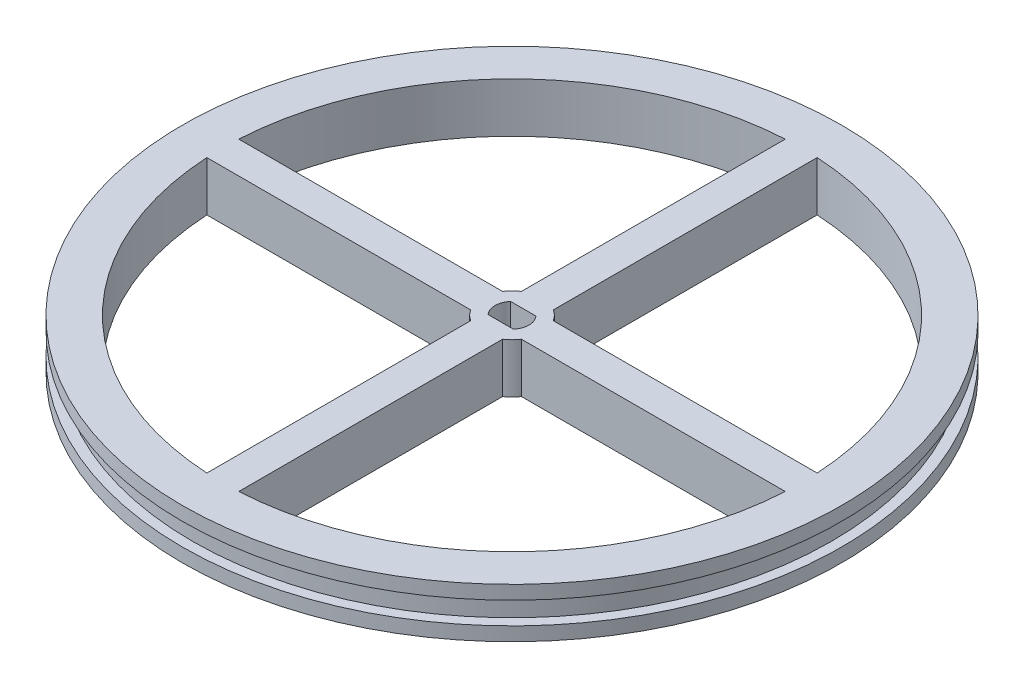
ISO-10303-21;
HEADER;
FILE_DESCRIPTION(('STEP AP214'),'2;1');
FILE_NAME('part.step','',(''),(''),'','','');
FILE_SCHEMA(('AUTOMOTIVE_DESIGN { 1 0 10303 214 1 1 1 1 }'));
ENDSEC;
DATA;
#1=APPLICATION_CONTEXT('core data for automotive mechanical design processes');
#2=APPLICATION_PROTOCOL_DEFINITION('international standard','automotive_design',2000,#1);
#3=PRODUCT_CONTEXT('',#1,'mechanical');
#4=PRODUCT('Part','Part','',(#3));
#5=PRODUCT_RELATED_PRODUCT_CATEGORY('part','',(#4));
#6=PRODUCT_DEFINITION_FORMATION('','',#4);
#7=PRODUCT_DEFINITION_CONTEXT('part definition',#1,'design');
#8=PRODUCT_DEFINITION('design','',#6,#7);
#9=PRODUCT_DEFINITION_SHAPE('','',#8);
#10=(LENGTH_UNIT() NAMED_UNIT(*) SI_UNIT(.MILLI.,.METRE.));
#11=(NAMED_UNIT(*) PLANE_ANGLE_UNIT() SI_UNIT($,.RADIAN.));
#12=(NAMED_UNIT(*) SI_UNIT($,.STERADIAN.) SOLID_ANGLE_UNIT());
#13=UNCERTAINTY_MEASURE_WITH_UNIT(LENGTH_MEASURE(1.E-05),#10,'distance_accuracy_value','');
#14=(GEOMETRIC_REPRESENTATION_CONTEXT(3) GLOBAL_UNCERTAINTY_ASSIGNED_CONTEXT((#13)) GLOBAL_UNIT_ASSIGNED_CONTEXT((#10,
#11,#12)) REPRESENTATION_CONTEXT('',''));
#15=CARTESIAN_POINT('',(0.,0.,0.));
#16=DIRECTION('',(0.,0.,1.));
#17=DIRECTION('',(1.,0.,0.));
#18=AXIS2_PLACEMENT_3D('',#15,#16,#17);
#19=CARTESIAN_POINT('',(0.,7.9,0.));
#20=DIRECTION('',(0.,-1.,0.));
#21=DIRECTION('',(0.,0.,-1.));
#22=AXIS2_PLACEMENT_3D('',#19,#20,#21);
#23=CYLINDRICAL_SURFACE('',#22,52.3875);
#24=CARTESIAN_POINT('',(0.,0.,0.));
#25=DIRECTION('',(0.,1.,0.));
#26=DIRECTION('',(0.,0.,1.));
#27=AXIS2_PLACEMENT_3D('',#24,#25,#26);
#28=CIRCLE('',#27,52.3875);
#29=CARTESIAN_POINT('',(0.,0.,52.3875));
#30=VERTEX_POINT('',#29);
#31=EDGE_CURVE('E277',#30,#30,#28,.T.);
#32=ORIENTED_EDGE('',*,*,#31,.T.);
#33=EDGE_LOOP('',(#32));
#34=FACE_BOUND('',#33,.T.);
#35=CARTESIAN_POINT('',(0.,2.1847,0.));
#36=DIRECTION('',(0.,1.,0.));
#37=DIRECTION('',(0.,0.,1.));
#38=AXIS2_PLACEMENT_3D('',#35,#36,#37);
#39=CIRCLE('',#38,52.3875);
#40=CARTESIAN_POINT('',(0.,2.1847,52.3875));
#41=VERTEX_POINT('',#40);
#42=EDGE_CURVE('E227',#41,#41,#39,.T.);
#43=ORIENTED_EDGE('',*,*,#42,.F.);
#44=EDGE_LOOP('',(#43));
#45=FACE_BOUND('',#44,.T.);
#46=ADVANCED_FACE('F47',(#34,#45),#23,.T.);
#47=CARTESIAN_POINT('',(0.,7.9,0.));
#48=DIRECTION('',(0.,-1.,0.));
#49=DIRECTION('',(0.,0.,-1.));
#50=AXIS2_PLACEMENT_3D('',#47,#48,#49);
#51=CYLINDRICAL_SURFACE('',#50,46.0375);
#52=CARTESIAN_POINT('',(0.,0.,0.));
#53=DIRECTION('',(0.,1.,0.));
#54=DIRECTION('',(0.,0.,1.));
#55=AXIS2_PLACEMENT_3D('',#52,#53,#54);
#56=CIRCLE('',#55,46.0375);
#57=CARTESIAN_POINT('',(-45.9673776307729,0.,2.53999999998384));
#58=VERTEX_POINT('',#57);
#59=CARTESIAN_POINT('',(-2.54000000001079,0.,45.9673776307714));
#60=VERTEX_POINT('',#59);
#61=EDGE_CURVE('E271',#58,#60,#56,.T.);
#62=ORIENTED_EDGE('',*,*,#61,.F.);
#63=DIRECTION('',(0.,-1.,0.));
#64=VECTOR('',#63,1.);
#65=CARTESIAN_POINT('',(-45.9673776307729,7.9,2.53999999998384));
#66=LINE('',#65,#64);
#67=CARTESIAN_POINT('',(-45.9673776307729,7.9,2.53999999998384));
#68=VERTEX_POINT('',#67);
#69=EDGE_CURVE('E12',#68,#58,#66,.T.);
#70=ORIENTED_EDGE('',*,*,#69,.F.);
#71=CARTESIAN_POINT('',(0.,7.9,0.));
#72=DIRECTION('',(0.,1.,0.));
#73=DIRECTION('',(0.,0.,1.));
#74=AXIS2_PLACEMENT_3D('',#71,#72,#73);
#75=CIRCLE('',#74,46.0375);
#76=CARTESIAN_POINT('',(-2.54000000001079,7.9,45.9673776307714));
#77=VERTEX_POINT('',#76);
#78=EDGE_CURVE('E212',#68,#77,#75,.T.);
#79=ORIENTED_EDGE('',*,*,#78,.T.);
#80=DIRECTION('',(0.,-1.,0.));
#81=VECTOR('',#80,1.);
#82=CARTESIAN_POINT('',(-2.54000000001079,7.9,45.9673776307714));
#83=LINE('',#82,#81);
#84=EDGE_CURVE('E137',#77,#60,#83,.T.);
#85=ORIENTED_EDGE('',*,*,#84,.T.);
#86=EDGE_LOOP('',(#62,#70,#79,#85));
#87=FACE_BOUND('',#86,.T.);
#88=ADVANCED_FACE('F345',(#87),#51,.F.);
#89=CARTESIAN_POINT('',(-8.89565653090244E-13,7.9,2.53999999999994));
#90=DIRECTION('',(-3.50222698067034E-13,0.,1.));
#91=DIRECTION('',(1.,0.,3.50222698067034E-13));
#92=AXIS2_PLACEMENT_3D('',#89,#90,#91);
#93=PLANE('',#92);
#94=DIRECTION('',(-1.,0.,-3.50222698067034E-13));
#95=VECTOR('',#94,1.);
#96=CARTESIAN_POINT('',(-8.89565653090244E-13,0.,2.53999999999994));
#97=LINE('',#96,#95);
#98=CARTESIAN_POINT('',(-4.02862336909361,0.,2.53999999999853));
#99=VERTEX_POINT('',#98);
#100=EDGE_CURVE('E201',#99,#58,#97,.T.);
#101=ORIENTED_EDGE('',*,*,#100,.F.);
#102=DIRECTION('',(0.,-1.,0.));
#103=VECTOR('',#102,1.);
#104=CARTESIAN_POINT('',(-4.02862336909361,7.9,2.53999999999853));
#105=LINE('',#104,#103);
#106=CARTESIAN_POINT('',(-4.02862336909361,7.9,2.53999999999853));
#107=VERTEX_POINT('',#106);
#108=EDGE_CURVE('E57',#107,#99,#105,.T.);
#109=ORIENTED_EDGE('',*,*,#108,.F.);
#110=DIRECTION('',(-1.,0.,-3.50222698067034E-13));
#111=VECTOR('',#110,1.);
#112=CARTESIAN_POINT('',(-8.89565653090244E-13,7.9,2.53999999999994));
#113=LINE('',#112,#111);
#114=EDGE_CURVE('E199',#107,#68,#113,.T.);
#115=ORIENTED_EDGE('',*,*,#114,.T.);
#116=ORIENTED_EDGE('',*,*,#69,.T.);
#117=EDGE_LOOP('',(#101,#109,#115,#116));
#118=FACE_BOUND('',#117,.T.);
#119=ADVANCED_FACE('F197',(#118),#93,.T.);
#120=CARTESIAN_POINT('',(0.,7.9,0.));
#121=DIRECTION('',(0.,-1.,0.));
#122=DIRECTION('',(0.,0.,-1.));
#123=AXIS2_PLACEMENT_3D('',#120,#121,#122);
#124=CYLINDRICAL_SURFACE('',#123,4.76249999999997);
#125=CARTESIAN_POINT('',(0.,0.,0.));
#126=DIRECTION('',(0.,1.,0.));
#127=DIRECTION('',(0.,0.,1.));
#128=AXIS2_PLACEMENT_3D('',#125,#126,#127);
#129=CIRCLE('',#128,4.76249999999997);
#130=CARTESIAN_POINT('',(-2.540000000001,0.,4.02862336909206));
#131=VERTEX_POINT('',#130);
#132=EDGE_CURVE('E274',#99,#131,#129,.T.);
#133=ORIENTED_EDGE('',*,*,#132,.T.);
#134=DIRECTION('',(0.,-1.,0.));
#135=VECTOR('',#134,1.);
#136=CARTESIAN_POINT('',(-2.540000000001,7.9,4.02862336909206));
#137=LINE('',#136,#135);
#138=CARTESIAN_POINT('',(-2.540000000001,7.9,4.02862336909206));
#139=VERTEX_POINT('',#138);
#140=EDGE_CURVE('E204',#139,#131,#137,.T.);
#141=ORIENTED_EDGE('',*,*,#140,.F.);
#142=CARTESIAN_POINT('',(0.,7.9,0.));
#143=DIRECTION('',(0.,1.,0.));
#144=DIRECTION('',(0.,0.,1.));
#145=AXIS2_PLACEMENT_3D('',#142,#143,#144);
#146=CIRCLE('',#145,4.76249999999997);
#147=EDGE_CURVE('E207',#107,#139,#146,.T.);
#148=ORIENTED_EDGE('',*,*,#147,.F.);
#149=ORIENTED_EDGE('',*,*,#108,.T.);
#150=EDGE_LOOP('',(#133,#141,#148,#149));
#151=FACE_BOUND('',#150,.T.);
#152=ADVANCED_FACE('F208',(#151),#124,.T.);
#153=CARTESIAN_POINT('',(0.,7.9,0.));
#154=DIRECTION('',(0.,-1.,0.));
#155=DIRECTION('',(0.,0.,-1.));
#156=AXIS2_PLACEMENT_3D('',#153,#154,#155);
#157=CYLINDRICAL_SURFACE('',#156,2.7);
#158=CARTESIAN_POINT('',(0.,0.,0.));
#159=DIRECTION('',(0.,1.,0.));
#160=DIRECTION('',(0.,0.,1.));
#161=AXIS2_PLACEMENT_3D('',#158,#159,#160);
#162=CIRCLE('',#161,2.7);
#163=CARTESIAN_POINT('',(2.01246117974981,0.,1.8));
#164=VERTEX_POINT('',#163);
#165=CARTESIAN_POINT('',(2.01246117974981,0.,-1.8));
#166=VERTEX_POINT('',#165);
#167=EDGE_CURVE('E259',#164,#166,#162,.T.);
#168=ORIENTED_EDGE('',*,*,#167,.F.);
#169=DIRECTION('',(0.,-1.,0.));
#170=VECTOR('',#169,1.);
#171=CARTESIAN_POINT('',(2.01246117974981,7.9,1.8));
#172=LINE('',#171,#170);
#173=CARTESIAN_POINT('',(2.01246117974981,7.9,1.8));
#174=VERTEX_POINT('',#173);
#175=EDGE_CURVE('E282',#174,#164,#172,.T.);
#176=ORIENTED_EDGE('',*,*,#175,.F.);
#177=CARTESIAN_POINT('',(0.,7.9,0.));
#178=DIRECTION('',(0.,1.,0.));
#179=DIRECTION('',(0.,0.,1.));
#180=AXIS2_PLACEMENT_3D('',#177,#178,#179);
#181=CIRCLE('',#180,2.7);
#182=CARTESIAN_POINT('',(2.01246117974981,7.9,-1.8));
#183=VERTEX_POINT('',#182);
#184=EDGE_CURVE('E408',#174,#183,#181,.T.);
#185=ORIENTED_EDGE('',*,*,#184,.T.);
#186=DIRECTION('',(0.,-1.,0.));
#187=VECTOR('',#186,1.);
#188=CARTESIAN_POINT('',(2.01246117974981,7.9,-1.8));
#189=LINE('',#188,#187);
#190=EDGE_CURVE('E284',#183,#166,#189,.T.);
#191=ORIENTED_EDGE('',*,*,#190,.T.);
#192=EDGE_LOOP('',(#168,#176,#185,#191));
#193=FACE_BOUND('',#192,.T.);
#194=ADVANCED_FACE('F426',(#193),#157,.F.);
#195=CARTESIAN_POINT('',(0.,7.9,1.8));
#196=DIRECTION('',(0.,0.,-1.));
#197=DIRECTION('',(-1.,0.,0.));
#198=AXIS2_PLACEMENT_3D('',#195,#196,#197);
#199=PLANE('',#198);
#200=DIRECTION('',(1.,0.,0.));
#201=VECTOR('',#200,1.);
#202=CARTESIAN_POINT('',(0.,0.,1.8));
#203=LINE('',#202,#201);
#204=CARTESIAN_POINT('',(-2.01246117974981,0.,1.8));
#205=VERTEX_POINT('',#204);
#206=EDGE_CURVE('E262',#205,#164,#203,.T.);
#207=ORIENTED_EDGE('',*,*,#206,.F.);
#208=DIRECTION('',(0.,-1.,0.));
#209=VECTOR('',#208,1.);
#210=CARTESIAN_POINT('',(-2.01246117974981,7.9,1.8));
#211=LINE('',#210,#209);
#212=CARTESIAN_POINT('',(-2.01246117974981,7.9,1.8));
#213=VERTEX_POINT('',#212);
#214=EDGE_CURVE('E289',#213,#205,#211,.T.);
#215=ORIENTED_EDGE('',*,*,#214,.F.);
#216=DIRECTION('',(1.,0.,0.));
#217=VECTOR('',#216,1.);
#218=CARTESIAN_POINT('',(0.,7.9,1.8));
#219=LINE('',#218,#217);
#220=EDGE_CURVE('E411',#213,#174,#219,.T.);
#221=ORIENTED_EDGE('',*,*,#220,.T.);
#222=ORIENTED_EDGE('',*,*,#175,.T.);
#223=EDGE_LOOP('',(#207,#215,#221,#222));
#224=FACE_BOUND('',#223,.T.);
#225=ADVANCED_FACE('F429',(#224),#199,.T.);
#226=CARTESIAN_POINT('',(0.,7.9,0.));
#227=DIRECTION('',(0.,-1.,0.));
#228=DIRECTION('',(0.,0.,-1.));
#229=AXIS2_PLACEMENT_3D('',#226,#227,#228);
#230=CYLINDRICAL_SURFACE('',#229,2.7);
#231=CARTESIAN_POINT('',(0.,0.,0.));
#232=DIRECTION('',(0.,1.,0.));
#233=DIRECTION('',(0.,0.,1.));
#234=AXIS2_PLACEMENT_3D('',#231,#232,#233);
#235=CIRCLE('',#234,2.7);
#236=CARTESIAN_POINT('',(-2.01246117974981,0.,-1.8));
#237=VERTEX_POINT('',#236);
#238=EDGE_CURVE('E265',#237,#205,#235,.T.);
#239=ORIENTED_EDGE('',*,*,#238,.F.);
#240=DIRECTION('',(0.,-1.,0.));
#241=VECTOR('',#240,1.);
#242=CARTESIAN_POINT('',(-2.01246117974981,7.9,-1.8));
#243=LINE('',#242,#241);
#244=CARTESIAN_POINT('',(-2.01246117974981,7.9,-1.8));
#245=VERTEX_POINT('',#244);
#246=EDGE_CURVE('E286',#245,#237,#243,.T.);
#247=ORIENTED_EDGE('',*,*,#246,.F.);
#248=CARTESIAN_POINT('',(0.,7.9,0.));
#249=DIRECTION('',(0.,1.,0.));
#250=DIRECTION('',(0.,0.,1.));
#251=AXIS2_PLACEMENT_3D('',#248,#249,#250);
#252=CIRCLE('',#251,2.7);
#253=EDGE_CURVE('E414',#245,#213,#252,.T.);
#254=ORIENTED_EDGE('',*,*,#253,.T.);
#255=ORIENTED_EDGE('',*,*,#214,.T.);
#256=EDGE_LOOP('',(#239,#247,#254,#255));
#257=FACE_BOUND('',#256,.T.);
#258=ADVANCED_FACE('F432',(#257),#230,.F.);
#259=CARTESIAN_POINT('',(2.53999999999994,7.9,5.9299999261304E-13));
#260=DIRECTION('',(1.,0.,2.33464564020888E-13));
#261=DIRECTION('',(2.33464564020888E-13,0.,-1.));
#262=AXIS2_PLACEMENT_3D('',#259,#260,#261);
#263=PLANE('',#262);
#264=DIRECTION('',(-2.33464564020888E-13,0.,1.));
#265=VECTOR('',#264,1.);
#266=CARTESIAN_POINT('',(2.53999999999994,0.,5.9299999261304E-13));
#267=LINE('',#266,#265);
#268=CARTESIAN_POINT('',(2.539999999999,0.,4.02862336909325));
#269=VERTEX_POINT('',#268);
#270=CARTESIAN_POINT('',(2.53999999998921,0.,45.9673776307725));
#271=VERTEX_POINT('',#270);
#272=EDGE_CURVE('E247',#269,#271,#267,.T.);
#273=ORIENTED_EDGE('',*,*,#272,.F.);
#274=DIRECTION('',(0.,-1.,0.));
#275=VECTOR('',#274,1.);
#276=CARTESIAN_POINT('',(2.539999999999,7.9,4.02862336909325));
#277=LINE('',#276,#275);
#278=CARTESIAN_POINT('',(2.539999999999,7.9,4.02862336909325));
#279=VERTEX_POINT('',#278);
#280=EDGE_CURVE('E287',#279,#269,#277,.T.);
#281=ORIENTED_EDGE('',*,*,#280,.F.);
#282=DIRECTION('',(-2.33464564020888E-13,0.,1.));
#283=VECTOR('',#282,1.);
#284=CARTESIAN_POINT('',(2.53999999999994,7.9,5.9299999261304E-13));
#285=LINE('',#284,#283);
#286=CARTESIAN_POINT('',(2.53999999998921,7.9,45.9673776307725));
#287=VERTEX_POINT('',#286);
#288=EDGE_CURVE('E397',#279,#287,#285,.T.);
#289=ORIENTED_EDGE('',*,*,#288,.T.);
#290=DIRECTION('',(0.,-1.,0.));
#291=VECTOR('',#290,1.);
#292=CARTESIAN_POINT('',(2.53999999998921,7.9,45.9673776307725));
#293=LINE('',#292,#291);
#294=EDGE_CURVE('E292',#287,#271,#293,.T.);
#295=ORIENTED_EDGE('',*,*,#294,.T.);
#296=EDGE_LOOP('',(#273,#281,#289,#295));
#297=FACE_BOUND('',#296,.T.);
#298=ADVANCED_FACE('F587',(#297),#263,.T.);
#299=CARTESIAN_POINT('',(0.,7.9,0.));
#300=DIRECTION('',(0.,-1.,0.));
#301=DIRECTION('',(0.,0.,-1.));
#302=AXIS2_PLACEMENT_3D('',#299,#300,#301);
#303=CYLINDRICAL_SURFACE('',#302,4.76249999999993);
#304=CARTESIAN_POINT('',(0.,0.,0.));
#305=DIRECTION('',(0.,1.,0.));
#306=DIRECTION('',(0.,0.,1.));
#307=AXIS2_PLACEMENT_3D('',#304,#305,#306);
#308=CIRCLE('',#307,4.76249999999993);
#309=CARTESIAN_POINT('',(4.02862336909236,0.,2.54000000000047));
#310=VERTEX_POINT('',#309);
#311=EDGE_CURVE('E250',#269,#310,#308,.T.);
#312=ORIENTED_EDGE('',*,*,#311,.T.);
#313=DIRECTION('',(0.,-1.,0.));
#314=VECTOR('',#313,1.);
#315=CARTESIAN_POINT('',(4.02862336909236,7.9,2.54000000000047));
#316=LINE('',#315,#314);
#317=CARTESIAN_POINT('',(4.02862336909236,7.9,2.54000000000047));
#318=VERTEX_POINT('',#317);
#319=EDGE_CURVE('E297',#318,#310,#316,.T.);
#320=ORIENTED_EDGE('',*,*,#319,.F.);
#321=CARTESIAN_POINT('',(0.,7.9,0.));
#322=DIRECTION('',(0.,1.,0.));
#323=DIRECTION('',(0.,0.,1.));
#324=AXIS2_PLACEMENT_3D('',#321,#322,#323);
#325=CIRCLE('',#324,4.76249999999993);
#326=EDGE_CURVE('E400',#279,#318,#325,.T.);
#327=ORIENTED_EDGE('',*,*,#326,.F.);
#328=ORIENTED_EDGE('',*,*,#280,.T.);
#329=EDGE_LOOP('',(#312,#320,#327,#328));
#330=FACE_BOUND('',#329,.T.);
#331=ADVANCED_FACE('F577',(#330),#303,.T.);
#332=CARTESIAN_POINT('',(-2.96513129140664E-13,7.9,2.54));
#333=DIRECTION('',(1.16737452417584E-13,0.,-1.));
#334=DIRECTION('',(-1.,0.,-1.16737452417584E-13));
#335=AXIS2_PLACEMENT_3D('',#332,#333,#334);
#336=PLANE('',#335);
#337=DIRECTION('',(1.,0.,1.16737452417584E-13));
#338=VECTOR('',#337,1.);
#339=CARTESIAN_POINT('',(-2.96513129140664E-13,0.,2.54));
#340=LINE('',#339,#338);
#341=CARTESIAN_POINT('',(45.9673776307717,0.,2.54000000000536));
#342=VERTEX_POINT('',#341);
#343=EDGE_CURVE('E253',#310,#342,#340,.T.);
#344=ORIENTED_EDGE('',*,*,#343,.T.);
#345=DIRECTION('',(0.,-1.,0.));
#346=VECTOR('',#345,1.);
#347=CARTESIAN_POINT('',(45.9673776307717,7.9,2.54000000000536));
#348=LINE('',#347,#346);
#349=CARTESIAN_POINT('',(45.9673776307717,7.9,2.54000000000536));
#350=VERTEX_POINT('',#349);
#351=EDGE_CURVE('E294',#350,#342,#348,.T.);
#352=ORIENTED_EDGE('',*,*,#351,.F.);
#353=DIRECTION('',(1.,0.,1.16737452417584E-13));
#354=VECTOR('',#353,1.);
#355=CARTESIAN_POINT('',(-2.96513129140664E-13,7.9,2.54));
#356=LINE('',#355,#354);
#357=EDGE_CURVE('E403',#318,#350,#356,.T.);
#358=ORIENTED_EDGE('',*,*,#357,.F.);
#359=ORIENTED_EDGE('',*,*,#319,.T.);
#360=EDGE_LOOP('',(#344,#352,#358,#359));
#361=FACE_BOUND('',#360,.T.);
#362=ADVANCED_FACE('F567',(#361),#336,.F.);
#363=CARTESIAN_POINT('',(2.96513129140664E-13,7.9,-2.54));
#364=DIRECTION('',(1.16737452417584E-13,0.,-1.));
#365=DIRECTION('',(-1.,0.,-1.16737452417584E-13));
#366=AXIS2_PLACEMENT_3D('',#363,#364,#365);
#367=PLANE('',#366);
#368=DIRECTION('',(1.,0.,1.16737452417584E-13));
#369=VECTOR('',#368,1.);
#370=CARTESIAN_POINT('',(2.96513129140664E-13,0.,-2.54));
#371=LINE('',#370,#369);
#372=CARTESIAN_POINT('',(4.02862336909296,0.,-2.53999999999953));
#373=VERTEX_POINT('',#372);
#374=CARTESIAN_POINT('',(45.9673776307722,0.,-2.53999999999464));
#375=VERTEX_POINT('',#374);
#376=EDGE_CURVE('E235',#373,#375,#371,.T.);
#377=ORIENTED_EDGE('',*,*,#376,.F.);
#378=DIRECTION('',(0.,-1.,0.));
#379=VECTOR('',#378,1.);
#380=CARTESIAN_POINT('',(4.02862336909296,7.9,-2.53999999999953));
#381=LINE('',#380,#379);
#382=CARTESIAN_POINT('',(4.02862336909296,7.9,-2.53999999999953));
#383=VERTEX_POINT('',#382);
#384=EDGE_CURVE('E295',#383,#373,#381,.T.);
#385=ORIENTED_EDGE('',*,*,#384,.F.);
#386=DIRECTION('',(1.,0.,1.16737452417584E-13));
#387=VECTOR('',#386,1.);
#388=CARTESIAN_POINT('',(2.96513129140664E-13,7.9,-2.54));
#389=LINE('',#388,#387);
#390=CARTESIAN_POINT('',(45.9673776307722,7.9,-2.53999999999464));
#391=VERTEX_POINT('',#390);
#392=EDGE_CURVE('E386',#383,#391,#389,.T.);
#393=ORIENTED_EDGE('',*,*,#392,.T.);
#394=DIRECTION('',(0.,-1.,0.));
#395=VECTOR('',#394,1.);
#396=CARTESIAN_POINT('',(45.9673776307722,7.9,-2.53999999999464));
#397=LINE('',#396,#395);
#398=EDGE_CURVE('E301',#391,#375,#397,.T.);
#399=ORIENTED_EDGE('',*,*,#398,.T.);
#400=EDGE_LOOP('',(#377,#385,#393,#399));
#401=FACE_BOUND('',#400,.T.);
#402=ADVANCED_FACE('F557',(#401),#367,.T.);
#403=CARTESIAN_POINT('',(0.,7.9,0.));
#404=DIRECTION('',(0.,-1.,0.));
#405=DIRECTION('',(0.,0.,-1.));
#406=AXIS2_PLACEMENT_3D('',#403,#404,#405);
#407=CYLINDRICAL_SURFACE('',#406,4.76249999999998);
#408=CARTESIAN_POINT('',(0.,0.,0.));
#409=DIRECTION('',(0.,1.,0.));
#410=DIRECTION('',(0.,0.,1.));
#411=AXIS2_PLACEMENT_3D('',#408,#409,#410);
#412=CIRCLE('',#411,4.76249999999998);
#413=CARTESIAN_POINT('',(2.54,0.,-4.02862336909272));
#414=VERTEX_POINT('',#413);
#415=EDGE_CURVE('E238',#373,#414,#412,.T.);
#416=ORIENTED_EDGE('',*,*,#415,.T.);
#417=DIRECTION('',(0.,-1.,0.));
#418=VECTOR('',#417,1.);
#419=CARTESIAN_POINT('',(2.54,7.9,-4.02862336909272));
#420=LINE('',#419,#418);
#421=CARTESIAN_POINT('',(2.54,7.9,-4.02862336909272));
#422=VERTEX_POINT('',#421);
#423=EDGE_CURVE('E305',#422,#414,#420,.T.);
#424=ORIENTED_EDGE('',*,*,#423,.F.);
#425=CARTESIAN_POINT('',(0.,7.9,0.));
#426=DIRECTION('',(0.,1.,0.));
#427=DIRECTION('',(0.,0.,1.));
#428=AXIS2_PLACEMENT_3D('',#425,#426,#427);
#429=CIRCLE('',#428,4.76249999999998);
#430=EDGE_CURVE('E389',#383,#422,#429,.T.);
#431=ORIENTED_EDGE('',*,*,#430,.F.);
#432=ORIENTED_EDGE('',*,*,#384,.T.);
#433=EDGE_LOOP('',(#416,#424,#431,#432));
#434=FACE_BOUND('',#433,.T.);
#435=ADVANCED_FACE('F547',(#434),#407,.T.);
#436=CARTESIAN_POINT('',(2.54,7.9,0.));
#437=DIRECTION('',(-1.,0.,0.));
#438=DIRECTION('',(0.,0.,1.));
#439=AXIS2_PLACEMENT_3D('',#436,#437,#438);
#440=PLANE('',#439);
#441=DIRECTION('',(0.,0.,-1.));
#442=VECTOR('',#441,1.);
#443=CARTESIAN_POINT('',(2.54,0.,0.));
#444=LINE('',#443,#442);
#445=CARTESIAN_POINT('',(2.54,0.,-45.967377630772));
#446=VERTEX_POINT('',#445);
#447=EDGE_CURVE('E241',#414,#446,#444,.T.);
#448=ORIENTED_EDGE('',*,*,#447,.T.);
#449=DIRECTION('',(0.,-1.,0.));
#450=VECTOR('',#449,1.);
#451=CARTESIAN_POINT('',(2.54,7.9,-45.967377630772));
#452=LINE('',#451,#450);
#453=CARTESIAN_POINT('',(2.54,7.9,-45.967377630772));
#454=VERTEX_POINT('',#453);
#455=EDGE_CURVE('E303',#454,#446,#452,.T.);
#456=ORIENTED_EDGE('',*,*,#455,.F.);
#457=DIRECTION('',(0.,0.,-1.));
#458=VECTOR('',#457,1.);
#459=CARTESIAN_POINT('',(2.54,7.9,0.));
#460=LINE('',#459,#458);
#461=EDGE_CURVE('E392',#422,#454,#460,.T.);
#462=ORIENTED_EDGE('',*,*,#461,.F.);
#463=ORIENTED_EDGE('',*,*,#423,.T.);
#464=EDGE_LOOP('',(#448,#456,#462,#463));
#465=FACE_BOUND('',#464,.T.);
#466=ADVANCED_FACE('F539',(#465),#440,.F.);
#467=CARTESIAN_POINT('',(-2.54,7.9,0.));
#468=DIRECTION('',(-1.,0.,0.));
#469=DIRECTION('',(0.,0.,1.));
#470=AXIS2_PLACEMENT_3D('',#467,#468,#469);
#471=PLANE('',#470);
#472=DIRECTION('',(0.,0.,-1.));
#473=VECTOR('',#472,1.);
#474=CARTESIAN_POINT('',(-2.54,0.,0.));
#475=LINE('',#474,#473);
#476=CARTESIAN_POINT('',(-2.54,0.,-4.02862336909272));
#477=VERTEX_POINT('',#476);
#478=CARTESIAN_POINT('',(-2.54,0.,-45.967377630772));
#479=VERTEX_POINT('',#478);
#480=EDGE_CURVE('E223',#477,#479,#475,.T.);
#481=ORIENTED_EDGE('',*,*,#480,.F.);
#482=DIRECTION('',(0.,-1.,0.));
#483=VECTOR('',#482,1.);
#484=CARTESIAN_POINT('',(-2.54,7.9,-4.02862336909272));
#485=LINE('',#484,#483);
#486=CARTESIAN_POINT('',(-2.54,7.9,-4.02862336909272));
#487=VERTEX_POINT('',#486);
#488=EDGE_CURVE('E51',#487,#477,#485,.T.);
#489=ORIENTED_EDGE('',*,*,#488,.F.);
#490=DIRECTION('',(0.,0.,-1.));
#491=VECTOR('',#490,1.);
#492=CARTESIAN_POINT('',(-2.54,7.9,0.));
#493=LINE('',#492,#491);
#494=CARTESIAN_POINT('',(-2.54,7.9,-45.967377630772));
#495=VERTEX_POINT('',#494);
#496=EDGE_CURVE('E280',#487,#495,#493,.T.);
#497=ORIENTED_EDGE('',*,*,#496,.T.);
#498=DIRECTION('',(0.,-1.,0.));
#499=VECTOR('',#498,1.);
#500=CARTESIAN_POINT('',(-2.54,7.9,-45.967377630772));
#501=LINE('',#500,#499);
#502=EDGE_CURVE('E222',#495,#479,#501,.T.);
#503=ORIENTED_EDGE('',*,*,#502,.T.);
#504=EDGE_LOOP('',(#481,#489,#497,#503));
#505=FACE_BOUND('',#504,.T.);
#506=ADVANCED_FACE('F49',(#505),#471,.T.);
#507=CARTESIAN_POINT('',(0.,7.9,0.));
#508=DIRECTION('',(0.,-1.,0.));
#509=DIRECTION('',(0.,0.,-1.));
#510=AXIS2_PLACEMENT_3D('',#507,#508,#509);
#511=CYLINDRICAL_SURFACE('',#510,4.76250000000002);
#512=CARTESIAN_POINT('',(0.,0.,0.));
#513=DIRECTION('',(0.,1.,0.));
#514=DIRECTION('',(0.,0.,1.));
#515=AXIS2_PLACEMENT_3D('',#512,#513,#514);
#516=CIRCLE('',#515,4.76250000000002);
#517=CARTESIAN_POINT('',(-4.02862336909183,0.,-2.54000000000147));
#518=VERTEX_POINT('',#517);
#519=EDGE_CURVE('E226',#477,#518,#516,.T.);
#520=ORIENTED_EDGE('',*,*,#519,.T.);
#521=DIRECTION('',(0.,-1.,0.));
#522=VECTOR('',#521,1.);
#523=CARTESIAN_POINT('',(-4.02862336909183,7.9,-2.54000000000147));
#524=LINE('',#523,#522);
#525=CARTESIAN_POINT('',(-4.02862336909183,7.9,-2.54000000000147));
#526=VERTEX_POINT('',#525);
#527=EDGE_CURVE('E311',#526,#518,#524,.T.);
#528=ORIENTED_EDGE('',*,*,#527,.F.);
#529=CARTESIAN_POINT('',(0.,7.9,0.));
#530=DIRECTION('',(0.,1.,0.));
#531=DIRECTION('',(0.,0.,1.));
#532=AXIS2_PLACEMENT_3D('',#529,#530,#531);
#533=CIRCLE('',#532,4.76250000000002);
#534=EDGE_CURVE('E320',#487,#526,#533,.T.);
#535=ORIENTED_EDGE('',*,*,#534,.F.);
#536=ORIENTED_EDGE('',*,*,#488,.T.);
#537=EDGE_LOOP('',(#520,#528,#535,#536));
#538=FACE_BOUND('',#537,.T.);
#539=ADVANCED_FACE('F319',(#538),#511,.T.);
#540=CARTESIAN_POINT('',(8.90773873830871E-13,7.9,-2.54000000000006));
#541=DIRECTION('',(-3.50698375523957E-13,0.,1.));
#542=DIRECTION('',(1.,0.,3.50698375523957E-13));
#543=AXIS2_PLACEMENT_3D('',#540,#541,#542);
#544=PLANE('',#543);
#545=DIRECTION('',(-1.,0.,-3.50698375523957E-13));
#546=VECTOR('',#545,1.);
#547=CARTESIAN_POINT('',(8.90773873830871E-13,0.,-2.54000000000006));
#548=LINE('',#547,#546);
#549=CARTESIAN_POINT('',(-45.9673776307711,0.,-2.54000000001618));
#550=VERTEX_POINT('',#549);
#551=EDGE_CURVE('E229',#518,#550,#548,.T.);
#552=ORIENTED_EDGE('',*,*,#551,.T.);
#553=DIRECTION('',(0.,-1.,0.));
#554=VECTOR('',#553,1.);
#555=CARTESIAN_POINT('',(-45.9673776307711,7.9,-2.54000000001618));
#556=LINE('',#555,#554);
#557=CARTESIAN_POINT('',(-45.9673776307711,7.9,-2.54000000001618));
#558=VERTEX_POINT('',#557);
#559=EDGE_CURVE('E310',#558,#550,#556,.T.);
#560=ORIENTED_EDGE('',*,*,#559,.F.);
#561=DIRECTION('',(-1.,0.,-3.50698375523957E-13));
#562=VECTOR('',#561,1.);
#563=CARTESIAN_POINT('',(8.90773873830871E-13,7.9,-2.54000000000006));
#564=LINE('',#563,#562);
#565=EDGE_CURVE('E383',#526,#558,#564,.T.);
#566=ORIENTED_EDGE('',*,*,#565,.F.);
#567=ORIENTED_EDGE('',*,*,#527,.T.);
#568=EDGE_LOOP('',(#552,#560,#566,#567));
#569=FACE_BOUND('',#568,.T.);
#570=ADVANCED_FACE('F332',(#569),#544,.F.);
#571=CARTESIAN_POINT('',(-2.54000000000006,7.9,-5.92999992613068E-13));
#572=DIRECTION('',(1.,0.,2.33464564020887E-13));
#573=DIRECTION('',(2.33464564020887E-13,0.,-1.));
#574=AXIS2_PLACEMENT_3D('',#571,#572,#573);
#575=PLANE('',#574);
#576=DIRECTION('',(-2.33464564020887E-13,0.,1.));
#577=VECTOR('',#576,1.);
#578=CARTESIAN_POINT('',(-2.54000000000006,0.,-5.92999992613068E-13));
#579=LINE('',#578,#577);
#580=EDGE_CURVE('E130',#131,#60,#579,.T.);
#581=ORIENTED_EDGE('',*,*,#580,.T.);
#582=ORIENTED_EDGE('',*,*,#84,.F.);
#583=DIRECTION('',(-2.33464564020887E-13,0.,1.));
#584=VECTOR('',#583,1.);
#585=CARTESIAN_POINT('',(-2.54000000000006,7.9,-5.92999992613068E-13));
#586=LINE('',#585,#584);
#587=EDGE_CURVE('E66',#139,#77,#586,.T.);
#588=ORIENTED_EDGE('',*,*,#587,.F.);
#589=ORIENTED_EDGE('',*,*,#140,.T.);
#590=EDGE_LOOP('',(#581,#582,#588,#589));
#591=FACE_BOUND('',#590,.T.);
#592=ADVANCED_FACE('F334',(#591),#575,.F.);
#593=CARTESIAN_POINT('',(0.,7.9,-1.8));
#594=DIRECTION('',(0.,0.,-1.));
#595=DIRECTION('',(-1.,0.,0.));
#596=AXIS2_PLACEMENT_3D('',#593,#594,#595);
#597=PLANE('',#596);
#598=DIRECTION('',(1.,0.,0.));
#599=VECTOR('',#598,1.);
#600=CARTESIAN_POINT('',(0.,0.,-1.8));
#601=LINE('',#600,#599);
#602=EDGE_CURVE('E268',#237,#166,#601,.T.);
#603=ORIENTED_EDGE('',*,*,#602,.T.);
#604=ORIENTED_EDGE('',*,*,#190,.F.);
#605=DIRECTION('',(1.,0.,0.));
#606=VECTOR('',#605,1.);
#607=CARTESIAN_POINT('',(0.,7.9,-1.8));
#608=LINE('',#607,#606);
#609=EDGE_CURVE('E214',#245,#183,#608,.T.);
#610=ORIENTED_EDGE('',*,*,#609,.F.);
#611=ORIENTED_EDGE('',*,*,#246,.T.);
#612=EDGE_LOOP('',(#603,#604,#610,#611));
#613=FACE_BOUND('',#612,.T.);
#614=ADVANCED_FACE('F340',(#613),#597,.F.);
#615=CARTESIAN_POINT('',(0.,7.9,0.));
#616=DIRECTION('',(0.,-1.,0.));
#617=DIRECTION('',(0.,0.,-1.));
#618=AXIS2_PLACEMENT_3D('',#615,#616,#617);
#619=CYLINDRICAL_SURFACE('',#618,46.0374999999999);
#620=CARTESIAN_POINT('',(0.,0.,0.));
#621=DIRECTION('',(0.,1.,0.));
#622=DIRECTION('',(0.,0.,1.));
#623=AXIS2_PLACEMENT_3D('',#620,#621,#622);
#624=CIRCLE('',#623,46.0374999999999);
#625=EDGE_CURVE('E256',#271,#342,#624,.T.);
#626=ORIENTED_EDGE('',*,*,#625,.F.);
#627=ORIENTED_EDGE('',*,*,#294,.F.);
#628=CARTESIAN_POINT('',(0.,7.9,0.));
#629=DIRECTION('',(0.,1.,0.));
#630=DIRECTION('',(0.,0.,1.));
#631=AXIS2_PLACEMENT_3D('',#628,#629,#630);
#632=CIRCLE('',#631,46.0374999999999);
#633=EDGE_CURVE('E405',#287,#350,#632,.T.);
#634=ORIENTED_EDGE('',*,*,#633,.T.);
#635=ORIENTED_EDGE('',*,*,#351,.T.);
#636=EDGE_LOOP('',(#626,#627,#634,#635));
#637=FACE_BOUND('',#636,.T.);
#638=ADVANCED_FACE('F497',(#637),#619,.F.);
#639=CARTESIAN_POINT('',(0.,7.9,0.));
#640=DIRECTION('',(0.,-1.,0.));
#641=DIRECTION('',(0.,0.,-1.));
#642=AXIS2_PLACEMENT_3D('',#639,#640,#641);
#643=CYLINDRICAL_SURFACE('',#642,46.0375);
#644=CARTESIAN_POINT('',(0.,0.,0.));
#645=DIRECTION('',(0.,1.,0.));
#646=DIRECTION('',(0.,0.,1.));
#647=AXIS2_PLACEMENT_3D('',#644,#645,#646);
#648=CIRCLE('',#647,46.0375);
#649=EDGE_CURVE('E244',#375,#446,#648,.T.);
#650=ORIENTED_EDGE('',*,*,#649,.F.);
#651=ORIENTED_EDGE('',*,*,#398,.F.);
#652=CARTESIAN_POINT('',(0.,7.9,0.));
#653=DIRECTION('',(0.,1.,0.));
#654=DIRECTION('',(0.,0.,1.));
#655=AXIS2_PLACEMENT_3D('',#652,#653,#654);
#656=CIRCLE('',#655,46.0375);
#657=EDGE_CURVE('E394',#391,#454,#656,.T.);
#658=ORIENTED_EDGE('',*,*,#657,.T.);
#659=ORIENTED_EDGE('',*,*,#455,.T.);
#660=EDGE_LOOP('',(#650,#651,#658,#659));
#661=FACE_BOUND('',#660,.T.);
#662=ADVANCED_FACE('F365',(#661),#643,.F.);
#663=CARTESIAN_POINT('',(0.,7.9,0.));
#664=DIRECTION('',(0.,-1.,0.));
#665=DIRECTION('',(0.,0.,-1.));
#666=AXIS2_PLACEMENT_3D('',#663,#664,#665);
#667=CYLINDRICAL_SURFACE('',#666,46.0375);
#668=CARTESIAN_POINT('',(0.,0.,0.));
#669=DIRECTION('',(0.,1.,0.));
#670=DIRECTION('',(0.,0.,1.));
#671=AXIS2_PLACEMENT_3D('',#668,#669,#670);
#672=CIRCLE('',#671,46.0375);
#673=EDGE_CURVE('E232',#479,#550,#672,.T.);
#674=ORIENTED_EDGE('',*,*,#673,.F.);
#675=ORIENTED_EDGE('',*,*,#502,.F.);
#676=CARTESIAN_POINT('',(0.,7.9,0.));
#677=DIRECTION('',(0.,1.,0.));
#678=DIRECTION('',(0.,0.,1.));
#679=AXIS2_PLACEMENT_3D('',#676,#677,#678);
#680=CIRCLE('',#679,46.0375);
#681=EDGE_CURVE('E330',#495,#558,#680,.T.);
#682=ORIENTED_EDGE('',*,*,#681,.T.);
#683=ORIENTED_EDGE('',*,*,#559,.T.);
#684=EDGE_LOOP('',(#674,#675,#682,#683));
#685=FACE_BOUND('',#684,.T.);
#686=ADVANCED_FACE('F329',(#685),#667,.F.);
#687=CARTESIAN_POINT('',(0.,5.7153,0.));
#688=DIRECTION('',(0.,1.,0.));
#689=DIRECTION('',(0.,0.,1.));
#690=AXIS2_PLACEMENT_3D('',#687,#688,#689);
#691=CIRCLE('',#690,52.3875);
#692=CARTESIAN_POINT('',(0.,5.7153,52.3875));
#693=VERTEX_POINT('',#692);
#694=EDGE_CURVE('E369',#693,#693,#691,.T.);
#695=ORIENTED_EDGE('',*,*,#694,.T.);
#696=EDGE_LOOP('',(#695));
#697=FACE_BOUND('',#696,.T.);
#698=CARTESIAN_POINT('',(0.,7.9,0.));
#699=DIRECTION('',(0.,1.,0.));
#700=DIRECTION('',(0.,0.,1.));
#701=AXIS2_PLACEMENT_3D('',#698,#699,#700);
#702=CIRCLE('',#701,52.3875);
#703=CARTESIAN_POINT('',(0.,7.9,52.3875));
#704=VERTEX_POINT('',#703);
#705=EDGE_CURVE('E219',#704,#704,#702,.T.);
#706=ORIENTED_EDGE('',*,*,#705,.F.);
#707=EDGE_LOOP('',(#706));
#708=FACE_BOUND('',#707,.T.);
#709=ADVANCED_FACE('F348',(#697,#708),#23,.T.);
#710=CARTESIAN_POINT('',(0.,7.9,0.));
#711=DIRECTION('',(0.,1.,0.));
#712=DIRECTION('',(0.,0.,1.));
#713=AXIS2_PLACEMENT_3D('',#710,#711,#712);
#714=PLANE('',#713);
#715=ORIENTED_EDGE('',*,*,#496,.F.);
#716=ORIENTED_EDGE('',*,*,#534,.T.);
#717=ORIENTED_EDGE('',*,*,#565,.T.);
#718=ORIENTED_EDGE('',*,*,#681,.F.);
#719=EDGE_LOOP('',(#715,#716,#717,#718));
#720=FACE_BOUND('',#719,.T.);
#721=ORIENTED_EDGE('',*,*,#392,.F.);
#722=ORIENTED_EDGE('',*,*,#430,.T.);
#723=ORIENTED_EDGE('',*,*,#461,.T.);
#724=ORIENTED_EDGE('',*,*,#657,.F.);
#725=EDGE_LOOP('',(#721,#722,#723,#724));
#726=FACE_BOUND('',#725,.T.);
#727=ORIENTED_EDGE('',*,*,#288,.F.);
#728=ORIENTED_EDGE('',*,*,#326,.T.);
#729=ORIENTED_EDGE('',*,*,#357,.T.);
#730=ORIENTED_EDGE('',*,*,#633,.F.);
#731=EDGE_LOOP('',(#727,#728,#729,#730));
#732=FACE_BOUND('',#731,.T.);
#733=ORIENTED_EDGE('',*,*,#184,.F.);
#734=ORIENTED_EDGE('',*,*,#220,.F.);
#735=ORIENTED_EDGE('',*,*,#253,.F.);
#736=ORIENTED_EDGE('',*,*,#609,.T.);
#737=EDGE_LOOP('',(#733,#734,#735,#736));
#738=FACE_BOUND('',#737,.T.);
#739=ORIENTED_EDGE('',*,*,#78,.F.);
#740=ORIENTED_EDGE('',*,*,#114,.F.);
#741=ORIENTED_EDGE('',*,*,#147,.T.);
#742=ORIENTED_EDGE('',*,*,#587,.T.);
#743=EDGE_LOOP('',(#739,#740,#741,#742));
#744=FACE_BOUND('',#743,.T.);
#745=ORIENTED_EDGE('',*,*,#705,.T.);
#746=EDGE_LOOP('',(#745));
#747=FACE_BOUND('',#746,.T.);
#748=ADVANCED_FACE('F210',(#720,#726,#732,#738,#744,#747),#714,.T.);
#749=CARTESIAN_POINT('',(0.,0.,0.));
#750=DIRECTION('',(0.,1.,0.));
#751=DIRECTION('',(0.,0.,1.));
#752=AXIS2_PLACEMENT_3D('',#749,#750,#751);
#753=PLANE('',#752);
#754=ORIENTED_EDGE('',*,*,#480,.T.);
#755=ORIENTED_EDGE('',*,*,#673,.T.);
#756=ORIENTED_EDGE('',*,*,#551,.F.);
#757=ORIENTED_EDGE('',*,*,#519,.F.);
#758=EDGE_LOOP('',(#754,#755,#756,#757));
#759=FACE_BOUND('',#758,.T.);
#760=ORIENTED_EDGE('',*,*,#376,.T.);
#761=ORIENTED_EDGE('',*,*,#649,.T.);
#762=ORIENTED_EDGE('',*,*,#447,.F.);
#763=ORIENTED_EDGE('',*,*,#415,.F.);
#764=EDGE_LOOP('',(#760,#761,#762,#763));
#765=FACE_BOUND('',#764,.T.);
#766=ORIENTED_EDGE('',*,*,#272,.T.);
#767=ORIENTED_EDGE('',*,*,#625,.T.);
#768=ORIENTED_EDGE('',*,*,#343,.F.);
#769=ORIENTED_EDGE('',*,*,#311,.F.);
#770=EDGE_LOOP('',(#766,#767,#768,#769));
#771=FACE_BOUND('',#770,.T.);
#772=ORIENTED_EDGE('',*,*,#167,.T.);
#773=ORIENTED_EDGE('',*,*,#602,.F.);
#774=ORIENTED_EDGE('',*,*,#238,.T.);
#775=ORIENTED_EDGE('',*,*,#206,.T.);
#776=EDGE_LOOP('',(#772,#773,#774,#775));
#777=FACE_BOUND('',#776,.T.);
#778=ORIENTED_EDGE('',*,*,#61,.T.);
#779=ORIENTED_EDGE('',*,*,#580,.F.);
#780=ORIENTED_EDGE('',*,*,#132,.F.);
#781=ORIENTED_EDGE('',*,*,#100,.T.);
#782=EDGE_LOOP('',(#778,#779,#780,#781));
#783=FACE_BOUND('',#782,.T.);
#784=ORIENTED_EDGE('',*,*,#31,.F.);
#785=EDGE_LOOP('',(#784));
#786=FACE_BOUND('',#785,.T.);
#787=ADVANCED_FACE('F323',(#759,#765,#771,#777,#783,#786),#753,.F.);
#788=CARTESIAN_POINT('',(0.,2.1847,0.));
#789=DIRECTION('',(0.,1.,0.));
#790=DIRECTION('',(0.,0.,1.));
#791=AXIS2_PLACEMENT_3D('',#788,#789,#790);
#792=PLANE('',#791);
#793=CARTESIAN_POINT('',(0.,2.1847,0.));
#794=DIRECTION('',(0.,1.,0.));
#795=DIRECTION('',(0.,0.,1.));
#796=AXIS2_PLACEMENT_3D('',#793,#794,#795);
#797=CIRCLE('',#796,50.8);
#798=CARTESIAN_POINT('',(0.,2.1847,50.8));
#799=VERTEX_POINT('',#798);
#800=EDGE_CURVE('E372',#799,#799,#797,.T.);
#801=ORIENTED_EDGE('',*,*,#800,.F.);
#802=EDGE_LOOP('',(#801));
#803=FACE_BOUND('',#802,.T.);
#804=ORIENTED_EDGE('',*,*,#42,.T.);
#805=EDGE_LOOP('',(#804));
#806=FACE_BOUND('',#805,.T.);
#807=ADVANCED_FACE('F435',(#803,#806),#792,.T.);
#808=CARTESIAN_POINT('',(0.,5.7153,0.));
#809=DIRECTION('',(0.,1.,0.));
#810=DIRECTION('',(0.,0.,1.));
#811=AXIS2_PLACEMENT_3D('',#808,#809,#810);
#812=PLANE('',#811);
#813=CARTESIAN_POINT('',(0.,5.7153,0.));
#814=DIRECTION('',(0.,1.,0.));
#815=DIRECTION('',(0.,0.,1.));
#816=AXIS2_PLACEMENT_3D('',#813,#814,#815);
#817=CIRCLE('',#816,50.8);
#818=CARTESIAN_POINT('',(0.,5.7153,50.8));
#819=VERTEX_POINT('',#818);
#820=EDGE_CURVE('E377',#819,#819,#817,.T.);
#821=ORIENTED_EDGE('',*,*,#820,.T.);
#822=EDGE_LOOP('',(#821));
#823=FACE_BOUND('',#822,.T.);
#824=ORIENTED_EDGE('',*,*,#694,.F.);
#825=EDGE_LOOP('',(#824));
#826=FACE_BOUND('',#825,.T.);
#827=ADVANCED_FACE('F438',(#823,#826),#812,.F.);
#828=CARTESIAN_POINT('',(0.,2.1847,0.));
#829=DIRECTION('',(0.,1.,0.));
#830=DIRECTION('',(0.,0.,1.));
#831=AXIS2_PLACEMENT_3D('',#828,#829,#830);
#832=CYLINDRICAL_SURFACE('',#831,50.8);
#833=ORIENTED_EDGE('',*,*,#800,.T.);
#834=EDGE_LOOP('',(#833));
#835=FACE_BOUND('',#834,.T.);
#836=ORIENTED_EDGE('',*,*,#820,.F.);
#837=EDGE_LOOP('',(#836));
#838=FACE_BOUND('',#837,.T.);
#839=ADVANCED_FACE('F443',(#835,#838),#832,.T.);
#840=CLOSED_SHELL('',(#46,#88,#119,#152,#194,#225,#258,#298,#331,#362,#402,#435,#466,#506,#539,
#570,#592,#614,#638,#662,#686,#709,#748,#787,#807,#827,#839));
#841=MANIFOLD_SOLID_BREP('B2',#840);
#842=ADVANCED_BREP_SHAPE_REPRESENTATION('',(#18,#841),#14);
#843=SHAPE_DEFINITION_REPRESENTATION(#9,#842);
ENDSEC;
END-ISO-10303-21;
